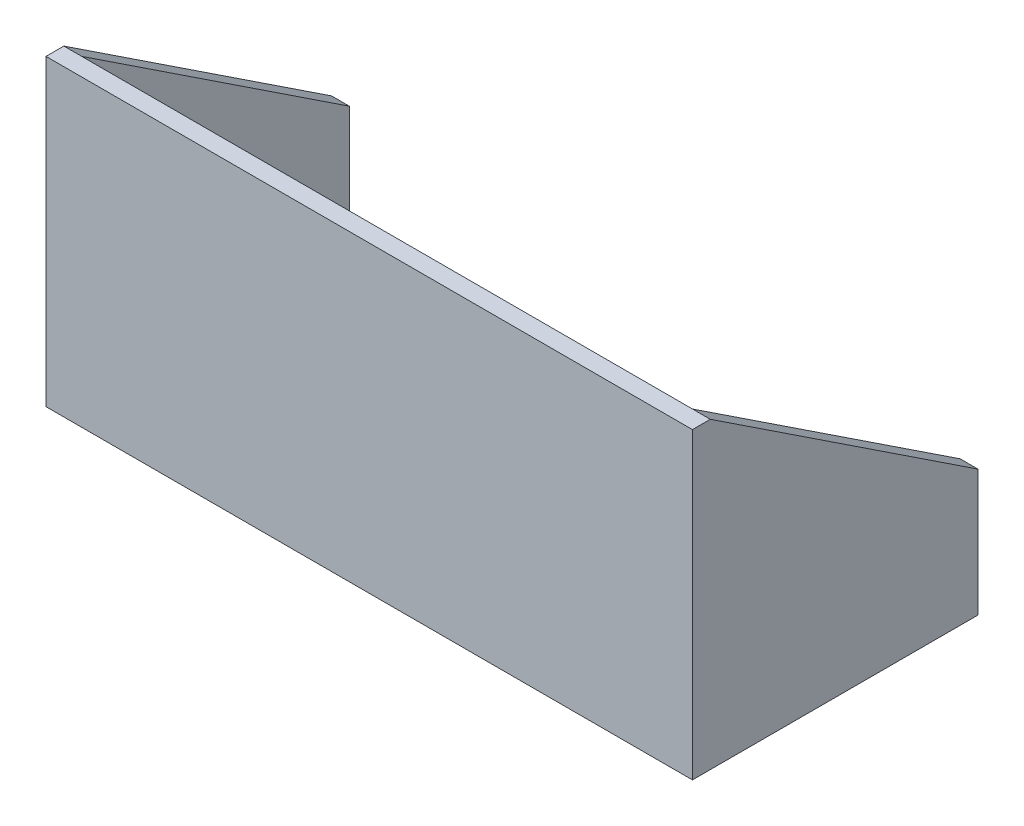
ISO-10303-21;
HEADER;
FILE_DESCRIPTION(('STEP AP214'),'2;1');
FILE_NAME('part.step','',(''),(''),'','','');
FILE_SCHEMA(('AUTOMOTIVE_DESIGN { 1 0 10303 214 1 1 1 1 }'));
ENDSEC;
DATA;
#1=APPLICATION_CONTEXT('core data for automotive mechanical design processes');
#2=APPLICATION_PROTOCOL_DEFINITION('international standard','automotive_design',2000,#1);
#3=PRODUCT_CONTEXT('',#1,'mechanical');
#4=PRODUCT('Part','Part','',(#3));
#5=PRODUCT_RELATED_PRODUCT_CATEGORY('part','',(#4));
#6=PRODUCT_DEFINITION_FORMATION('','',#4);
#7=PRODUCT_DEFINITION_CONTEXT('part definition',#1,'design');
#8=PRODUCT_DEFINITION('design','',#6,#7);
#9=PRODUCT_DEFINITION_SHAPE('','',#8);
#10=(LENGTH_UNIT() NAMED_UNIT(*) SI_UNIT(.MILLI.,.METRE.));
#11=(NAMED_UNIT(*) PLANE_ANGLE_UNIT() SI_UNIT($,.RADIAN.));
#12=(NAMED_UNIT(*) SI_UNIT($,.STERADIAN.) SOLID_ANGLE_UNIT());
#13=UNCERTAINTY_MEASURE_WITH_UNIT(LENGTH_MEASURE(1.E-05),#10,'distance_accuracy_value','');
#14=(GEOMETRIC_REPRESENTATION_CONTEXT(3) GLOBAL_UNCERTAINTY_ASSIGNED_CONTEXT((#13)) GLOBAL_UNIT_ASSIGNED_CONTEXT((#10,
#11,#12)) REPRESENTATION_CONTEXT('',''));
#15=CARTESIAN_POINT('',(0.,0.,0.));
#16=DIRECTION('',(0.,0.,1.));
#17=DIRECTION('',(1.,0.,0.));
#18=AXIS2_PLACEMENT_3D('',#15,#16,#17);
#19=CARTESIAN_POINT('',(115.,3.175,44.45));
#20=DIRECTION('',(0.,-1.,0.));
#21=DIRECTION('',(0.,0.,-1.));
#22=AXIS2_PLACEMENT_3D('',#19,#20,#21);
#23=PLANE('',#22);
#24=DIRECTION('',(-1.,0.,0.));
#25=VECTOR('',#24,1.);
#26=CARTESIAN_POINT('',(115.,3.175,44.45));
#27=LINE('',#26,#25);
#28=CARTESIAN_POINT('',(108.65,3.175,44.45));
#29=VERTEX_POINT('',#28);
#30=CARTESIAN_POINT('',(-108.65,3.175,44.45));
#31=VERTEX_POINT('',#30);
#32=EDGE_CURVE('E107',#29,#31,#27,.T.);
#33=ORIENTED_EDGE('',*,*,#32,.F.);
#34=DIRECTION('',(0.,0.,1.));
#35=VECTOR('',#34,1.);
#36=CARTESIAN_POINT('',(108.65,3.175,-50.8));
#37=LINE('',#36,#35);
#38=CARTESIAN_POINT('',(108.65,3.175,-50.8));
#39=VERTEX_POINT('',#38);
#40=EDGE_CURVE('E180',#39,#29,#37,.T.);
#41=ORIENTED_EDGE('',*,*,#40,.F.);
#42=DIRECTION('',(-1.,0.,0.));
#43=VECTOR('',#42,1.);
#44=CARTESIAN_POINT('',(115.,3.175,-50.8));
#45=LINE('',#44,#43);
#46=CARTESIAN_POINT('',(-108.65,3.175,-50.8));
#47=VERTEX_POINT('',#46);
#48=EDGE_CURVE('E11',#39,#47,#45,.T.);
#49=ORIENTED_EDGE('',*,*,#48,.T.);
#50=DIRECTION('',(0.,0.,1.));
#51=VECTOR('',#50,1.);
#52=CARTESIAN_POINT('',(-108.65,3.175,-50.8));
#53=LINE('',#52,#51);
#54=EDGE_CURVE('E147',#47,#31,#53,.T.);
#55=ORIENTED_EDGE('',*,*,#54,.T.);
#56=EDGE_LOOP('',(#33,#41,#49,#55));
#57=FACE_BOUND('',#56,.T.);
#58=ADVANCED_FACE('F41',(#57),#23,.F.);
#59=CARTESIAN_POINT('',(115.,-3.175,-50.8));
#60=DIRECTION('',(0.,0.,1.));
#61=DIRECTION('',(1.,0.,0.));
#62=AXIS2_PLACEMENT_3D('',#59,#60,#61);
#63=PLANE('',#62);
#64=DIRECTION('',(0.,1.,0.));
#65=VECTOR('',#64,1.);
#66=CARTESIAN_POINT('',(-115.,-3.175,-50.8));
#67=LINE('',#66,#65);
#68=CARTESIAN_POINT('',(-115.,-3.175,-50.8));
#69=VERTEX_POINT('',#68);
#70=CARTESIAN_POINT('',(-115.,41.8028957913928,-50.8));
#71=VERTEX_POINT('',#70);
#72=EDGE_CURVE('E96',#69,#71,#67,.T.);
#73=ORIENTED_EDGE('',*,*,#72,.T.);
#74=DIRECTION('',(-1.,0.,0.));
#75=VECTOR('',#74,1.);
#76=CARTESIAN_POINT('',(-108.65,41.8028957913928,-50.8));
#77=LINE('',#76,#75);
#78=CARTESIAN_POINT('',(-108.65,41.8028957913928,-50.8));
#79=VERTEX_POINT('',#78);
#80=EDGE_CURVE('E139',#79,#71,#77,.T.);
#81=ORIENTED_EDGE('',*,*,#80,.F.);
#82=DIRECTION('',(0.,-1.,0.));
#83=VECTOR('',#82,1.);
#84=CARTESIAN_POINT('',(-108.65,41.8028957913928,-50.8));
#85=LINE('',#84,#83);
#86=EDGE_CURVE('E157',#79,#47,#85,.T.);
#87=ORIENTED_EDGE('',*,*,#86,.T.);
#88=ORIENTED_EDGE('',*,*,#48,.F.);
#89=DIRECTION('',(0.,-1.,0.));
#90=VECTOR('',#89,1.);
#91=CARTESIAN_POINT('',(108.65,41.8028957913928,-50.8));
#92=LINE('',#91,#90);
#93=CARTESIAN_POINT('',(108.65,41.8028957913928,-50.8));
#94=VERTEX_POINT('',#93);
#95=EDGE_CURVE('E176',#94,#39,#92,.T.);
#96=ORIENTED_EDGE('',*,*,#95,.F.);
#97=DIRECTION('',(1.,0.,0.));
#98=VECTOR('',#97,1.);
#99=CARTESIAN_POINT('',(108.65,41.8028957913928,-50.8));
#100=LINE('',#99,#98);
#101=CARTESIAN_POINT('',(115.,41.8028957913928,-50.8));
#102=VERTEX_POINT('',#101);
#103=EDGE_CURVE('E153',#94,#102,#100,.T.);
#104=ORIENTED_EDGE('',*,*,#103,.T.);
#105=DIRECTION('',(0.,1.,0.));
#106=VECTOR('',#105,1.);
#107=CARTESIAN_POINT('',(115.,-3.175,-50.8));
#108=LINE('',#107,#106);
#109=CARTESIAN_POINT('',(115.,-3.175,-50.8));
#110=VERTEX_POINT('',#109);
#111=EDGE_CURVE('E89',#110,#102,#108,.T.);
#112=ORIENTED_EDGE('',*,*,#111,.F.);
#113=DIRECTION('',(-1.,0.,0.));
#114=VECTOR('',#113,1.);
#115=CARTESIAN_POINT('',(115.,-3.175,-50.8));
#116=LINE('',#115,#114);
#117=EDGE_CURVE('E82',#110,#69,#116,.T.);
#118=ORIENTED_EDGE('',*,*,#117,.T.);
#119=EDGE_LOOP('',(#73,#81,#87,#88,#96,#104,#112,#118));
#120=FACE_BOUND('',#119,.T.);
#121=ADVANCED_FACE('F43',(#120),#63,.F.);
#122=CARTESIAN_POINT('',(115.,-3.175,50.8));
#123=DIRECTION('',(0.,0.,-1.));
#124=DIRECTION('',(-1.,0.,0.));
#125=AXIS2_PLACEMENT_3D('',#122,#123,#124);
#126=PLANE('',#125);
#127=DIRECTION('',(0.,-1.,0.));
#128=VECTOR('',#127,1.);
#129=CARTESIAN_POINT('',(115.,3.175,50.8));
#130=LINE('',#129,#128);
#131=CARTESIAN_POINT('',(115.,104.775,50.8));
#132=VERTEX_POINT('',#131);
#133=CARTESIAN_POINT('',(115.,-3.175,50.8));
#134=VERTEX_POINT('',#133);
#135=EDGE_CURVE('E120',#132,#134,#130,.T.);
#136=ORIENTED_EDGE('',*,*,#135,.F.);
#137=DIRECTION('',(-1.,0.,0.));
#138=VECTOR('',#137,1.);
#139=CARTESIAN_POINT('',(137.514051168104,104.775,50.8));
#140=LINE('',#139,#138);
#141=CARTESIAN_POINT('',(-115.,104.775,50.8));
#142=VERTEX_POINT('',#141);
#143=EDGE_CURVE('E127',#132,#142,#140,.T.);
#144=ORIENTED_EDGE('',*,*,#143,.T.);
#145=DIRECTION('',(0.,-1.,0.));
#146=VECTOR('',#145,1.);
#147=CARTESIAN_POINT('',(-115.,-3.175,50.8));
#148=LINE('',#147,#146);
#149=CARTESIAN_POINT('',(-115.,-3.175,50.8));
#150=VERTEX_POINT('',#149);
#151=EDGE_CURVE('E90',#142,#150,#148,.T.);
#152=ORIENTED_EDGE('',*,*,#151,.T.);
#153=DIRECTION('',(-1.,0.,0.));
#154=VECTOR('',#153,1.);
#155=CARTESIAN_POINT('',(115.,-3.175,50.8));
#156=LINE('',#155,#154);
#157=EDGE_CURVE('E50',#134,#150,#156,.T.);
#158=ORIENTED_EDGE('',*,*,#157,.F.);
#159=EDGE_LOOP('',(#136,#144,#152,#158));
#160=FACE_BOUND('',#159,.T.);
#161=ADVANCED_FACE('F231',(#160),#126,.F.);
#162=CARTESIAN_POINT('',(115.,-3.175,50.8));
#163=DIRECTION('',(0.,1.,0.));
#164=DIRECTION('',(0.,0.,1.));
#165=AXIS2_PLACEMENT_3D('',#162,#163,#164);
#166=PLANE('',#165);
#167=DIRECTION('',(0.,0.,-1.));
#168=VECTOR('',#167,1.);
#169=CARTESIAN_POINT('',(-115.,-3.175,50.8));
#170=LINE('',#169,#168);
#171=EDGE_CURVE('E79',#150,#69,#170,.T.);
#172=ORIENTED_EDGE('',*,*,#171,.T.);
#173=ORIENTED_EDGE('',*,*,#117,.F.);
#174=DIRECTION('',(0.,0.,-1.));
#175=VECTOR('',#174,1.);
#176=CARTESIAN_POINT('',(115.,-3.175,50.8));
#177=LINE('',#176,#175);
#178=EDGE_CURVE('E66',#134,#110,#177,.T.);
#179=ORIENTED_EDGE('',*,*,#178,.F.);
#180=ORIENTED_EDGE('',*,*,#157,.T.);
#181=EDGE_LOOP('',(#172,#173,#179,#180));
#182=FACE_BOUND('',#181,.T.);
#183=ADVANCED_FACE('F81',(#182),#166,.F.);
#184=CARTESIAN_POINT('',(115.,0.,0.));
#185=DIRECTION('',(-1.,0.,0.));
#186=DIRECTION('',(0.,0.,1.));
#187=AXIS2_PLACEMENT_3D('',#184,#185,#186);
#188=PLANE('',#187);
#189=ORIENTED_EDGE('',*,*,#111,.T.);
#190=DIRECTION('',(0.,-0.551495420971773,-0.834177919059937));
#191=VECTOR('',#190,1.);
#192=CARTESIAN_POINT('',(115.,104.775,44.45));
#193=LINE('',#192,#191);
#194=CARTESIAN_POINT('',(115.,104.775,44.45));
#195=VERTEX_POINT('',#194);
#196=EDGE_CURVE('E171',#195,#102,#193,.T.);
#197=ORIENTED_EDGE('',*,*,#196,.F.);
#198=DIRECTION('',(0.,0.,1.));
#199=VECTOR('',#198,1.);
#200=CARTESIAN_POINT('',(115.,104.775,44.45));
#201=LINE('',#200,#199);
#202=EDGE_CURVE('E113',#195,#132,#201,.T.);
#203=ORIENTED_EDGE('',*,*,#202,.T.);
#204=ORIENTED_EDGE('',*,*,#135,.T.);
#205=ORIENTED_EDGE('',*,*,#178,.T.);
#206=EDGE_LOOP('',(#189,#197,#203,#204,#205));
#207=FACE_BOUND('',#206,.T.);
#208=ADVANCED_FACE('F233',(#207),#188,.F.);
#209=CARTESIAN_POINT('',(-115.,0.,0.));
#210=DIRECTION('',(-1.,0.,0.));
#211=DIRECTION('',(0.,0.,1.));
#212=AXIS2_PLACEMENT_3D('',#209,#210,#211);
#213=PLANE('',#212);
#214=ORIENTED_EDGE('',*,*,#151,.F.);
#215=DIRECTION('',(0.,0.,-1.));
#216=VECTOR('',#215,1.);
#217=CARTESIAN_POINT('',(-115.,104.775,44.45));
#218=LINE('',#217,#216);
#219=CARTESIAN_POINT('',(-115.,104.775,44.45));
#220=VERTEX_POINT('',#219);
#221=EDGE_CURVE('E132',#142,#220,#218,.T.);
#222=ORIENTED_EDGE('',*,*,#221,.T.);
#223=DIRECTION('',(0.,-0.551495420971773,-0.834177919059937));
#224=VECTOR('',#223,1.);
#225=CARTESIAN_POINT('',(-115.,104.775,44.45));
#226=LINE('',#225,#224);
#227=EDGE_CURVE('E105',#220,#71,#226,.T.);
#228=ORIENTED_EDGE('',*,*,#227,.T.);
#229=ORIENTED_EDGE('',*,*,#72,.F.);
#230=ORIENTED_EDGE('',*,*,#171,.F.);
#231=EDGE_LOOP('',(#214,#222,#228,#229,#230));
#232=FACE_BOUND('',#231,.T.);
#233=ADVANCED_FACE('F102',(#232),#213,.T.);
#234=CARTESIAN_POINT('',(115.,3.175,44.45));
#235=DIRECTION('',(0.,0.,1.));
#236=DIRECTION('',(0.,-1.,0.));
#237=AXIS2_PLACEMENT_3D('',#234,#235,#236);
#238=PLANE('',#237);
#239=DIRECTION('',(-1.,0.,0.));
#240=VECTOR('',#239,1.);
#241=CARTESIAN_POINT('',(137.514051168104,104.775,44.45));
#242=LINE('',#241,#240);
#243=CARTESIAN_POINT('',(108.65,104.775,44.45));
#244=VERTEX_POINT('',#243);
#245=CARTESIAN_POINT('',(-108.65,104.775,44.45));
#246=VERTEX_POINT('',#245);
#247=EDGE_CURVE('E131',#244,#246,#242,.T.);
#248=ORIENTED_EDGE('',*,*,#247,.F.);
#249=DIRECTION('',(0.,1.,0.));
#250=VECTOR('',#249,1.);
#251=CARTESIAN_POINT('',(108.65,3.175,44.45));
#252=LINE('',#251,#250);
#253=EDGE_CURVE('E57',#29,#244,#252,.T.);
#254=ORIENTED_EDGE('',*,*,#253,.F.);
#255=ORIENTED_EDGE('',*,*,#32,.T.);
#256=DIRECTION('',(0.,1.,0.));
#257=VECTOR('',#256,1.);
#258=CARTESIAN_POINT('',(-108.65,3.175,44.45));
#259=LINE('',#258,#257);
#260=EDGE_CURVE('E152',#31,#246,#259,.T.);
#261=ORIENTED_EDGE('',*,*,#260,.T.);
#262=EDGE_LOOP('',(#248,#254,#255,#261));
#263=FACE_BOUND('',#262,.T.);
#264=ADVANCED_FACE('F207',(#263),#238,.F.);
#265=CARTESIAN_POINT('',(137.514051168104,104.775,44.45));
#266=DIRECTION('',(0.,1.,0.));
#267=DIRECTION('',(0.,0.,1.));
#268=AXIS2_PLACEMENT_3D('',#265,#266,#267);
#269=PLANE('',#268);
#270=ORIENTED_EDGE('',*,*,#202,.F.);
#271=EDGE_CURVE('E133',#195,#244,#242,.T.);
#272=ORIENTED_EDGE('',*,*,#271,.T.);
#273=ORIENTED_EDGE('',*,*,#247,.T.);
#274=DIRECTION('',(-1.,0.,0.));
#275=VECTOR('',#274,1.);
#276=CARTESIAN_POINT('',(-108.65,104.775,44.45));
#277=LINE('',#276,#275);
#278=EDGE_CURVE('E143',#246,#220,#277,.T.);
#279=ORIENTED_EDGE('',*,*,#278,.T.);
#280=ORIENTED_EDGE('',*,*,#221,.F.);
#281=ORIENTED_EDGE('',*,*,#143,.F.);
#282=EDGE_LOOP('',(#270,#272,#273,#279,#280,#281));
#283=FACE_BOUND('',#282,.T.);
#284=ADVANCED_FACE('F191',(#283),#269,.T.);
#285=CARTESIAN_POINT('',(-108.65,104.775,44.45));
#286=DIRECTION('',(0.,0.834177919059937,-0.551495420971773));
#287=DIRECTION('',(0.,0.551495420971773,0.834177919059937));
#288=AXIS2_PLACEMENT_3D('',#285,#286,#287);
#289=PLANE('',#288);
#290=ORIENTED_EDGE('',*,*,#227,.F.);
#291=ORIENTED_EDGE('',*,*,#278,.F.);
#292=DIRECTION('',(0.,-0.551495420971773,-0.834177919059937));
#293=VECTOR('',#292,1.);
#294=CARTESIAN_POINT('',(-108.65,104.775,44.45));
#295=LINE('',#294,#293);
#296=EDGE_CURVE('E161',#246,#79,#295,.T.);
#297=ORIENTED_EDGE('',*,*,#296,.T.);
#298=ORIENTED_EDGE('',*,*,#80,.T.);
#299=EDGE_LOOP('',(#290,#291,#297,#298));
#300=FACE_BOUND('',#299,.T.);
#301=ADVANCED_FACE('F200',(#300),#289,.T.);
#302=CARTESIAN_POINT('',(-108.65,0.,0.));
#303=DIRECTION('',(1.,0.,0.));
#304=DIRECTION('',(0.,0.,-1.));
#305=AXIS2_PLACEMENT_3D('',#302,#303,#304);
#306=PLANE('',#305);
#307=ORIENTED_EDGE('',*,*,#260,.F.);
#308=ORIENTED_EDGE('',*,*,#54,.F.);
#309=ORIENTED_EDGE('',*,*,#86,.F.);
#310=ORIENTED_EDGE('',*,*,#296,.F.);
#311=EDGE_LOOP('',(#307,#308,#309,#310));
#312=FACE_BOUND('',#311,.T.);
#313=ADVANCED_FACE('F204',(#312),#306,.T.);
#314=CARTESIAN_POINT('',(108.65,104.775,44.45));
#315=DIRECTION('',(0.,-0.834177919059937,0.551495420971773));
#316=DIRECTION('',(0.,-0.551495420971773,-0.834177919059937));
#317=AXIS2_PLACEMENT_3D('',#314,#315,#316);
#318=PLANE('',#317);
#319=ORIENTED_EDGE('',*,*,#196,.T.);
#320=ORIENTED_EDGE('',*,*,#103,.F.);
#321=DIRECTION('',(0.,-0.551495420971773,-0.834177919059937));
#322=VECTOR('',#321,1.);
#323=CARTESIAN_POINT('',(108.65,104.775,44.45));
#324=LINE('',#323,#322);
#325=EDGE_CURVE('E170',#244,#94,#324,.T.);
#326=ORIENTED_EDGE('',*,*,#325,.F.);
#327=ORIENTED_EDGE('',*,*,#271,.F.);
#328=EDGE_LOOP('',(#319,#320,#326,#327));
#329=FACE_BOUND('',#328,.T.);
#330=ADVANCED_FACE('F236',(#329),#318,.F.);
#331=CARTESIAN_POINT('',(108.65,0.,0.));
#332=DIRECTION('',(-1.,0.,0.));
#333=DIRECTION('',(0.,0.,-1.));
#334=AXIS2_PLACEMENT_3D('',#331,#332,#333);
#335=PLANE('',#334);
#336=ORIENTED_EDGE('',*,*,#253,.T.);
#337=ORIENTED_EDGE('',*,*,#325,.T.);
#338=ORIENTED_EDGE('',*,*,#95,.T.);
#339=ORIENTED_EDGE('',*,*,#40,.T.);
#340=EDGE_LOOP('',(#336,#337,#338,#339));
#341=FACE_BOUND('',#340,.T.);
#342=ADVANCED_FACE('F238',(#341),#335,.T.);
#343=CLOSED_SHELL('',(#58,#121,#161,#183,#208,#233,#264,#284,#301,#313,#330,#342));
#344=MANIFOLD_SOLID_BREP('B2',#343);
#345=ADVANCED_BREP_SHAPE_REPRESENTATION('',(#18,#344),#14);
#346=SHAPE_DEFINITION_REPRESENTATION(#9,#345);
ENDSEC;
END-ISO-10303-21;
